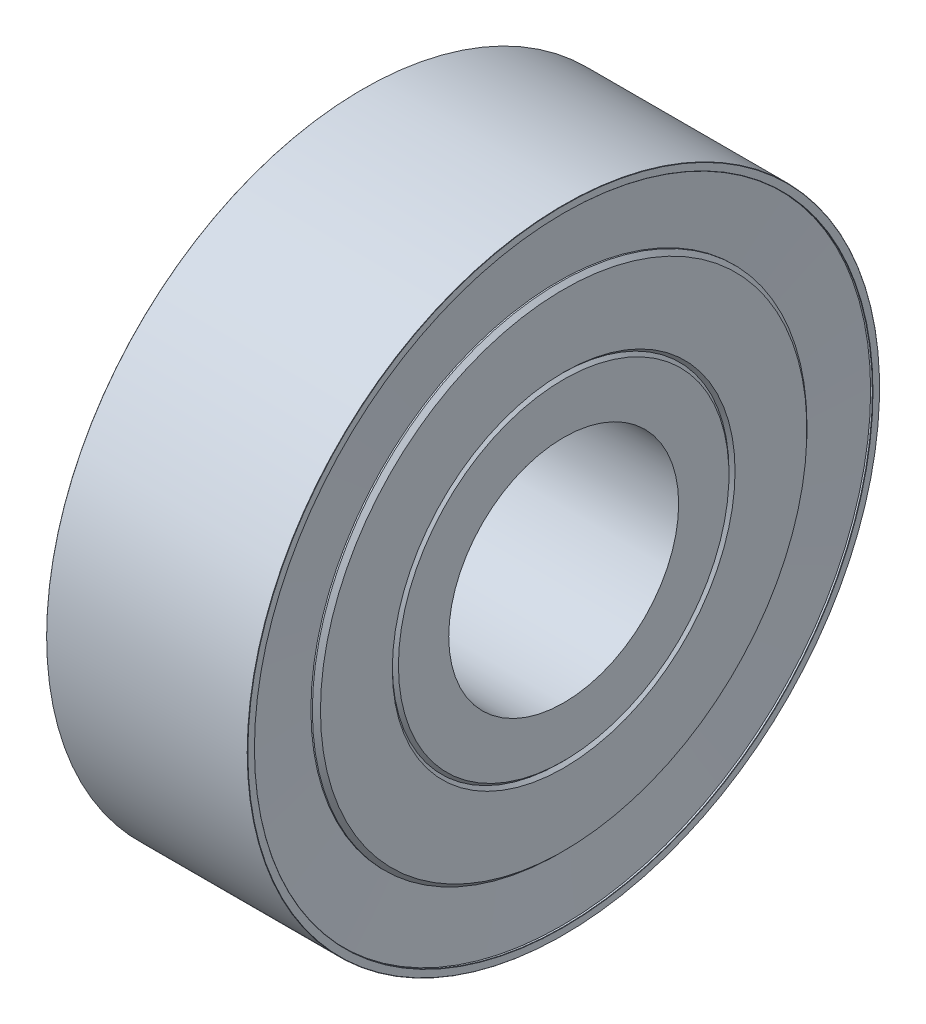
ISO-10303-21;
HEADER;
FILE_DESCRIPTION(('STEP AP214'),'2;1');
FILE_NAME('part.step','',(''),(''),'','','');
FILE_SCHEMA(('AUTOMOTIVE_DESIGN { 1 0 10303 214 1 1 1 1 }'));
ENDSEC;
DATA;
#1=APPLICATION_CONTEXT('core data for automotive mechanical design processes');
#2=APPLICATION_PROTOCOL_DEFINITION('international standard','automotive_design',2000,#1);
#3=PRODUCT_CONTEXT('',#1,'mechanical');
#4=PRODUCT('Part','Part','',(#3));
#5=PRODUCT_RELATED_PRODUCT_CATEGORY('part','',(#4));
#6=PRODUCT_DEFINITION_FORMATION('','',#4);
#7=PRODUCT_DEFINITION_CONTEXT('part definition',#1,'design');
#8=PRODUCT_DEFINITION('design','',#6,#7);
#9=PRODUCT_DEFINITION_SHAPE('','',#8);
#10=(LENGTH_UNIT() NAMED_UNIT(*) SI_UNIT(.MILLI.,.METRE.));
#11=(NAMED_UNIT(*) PLANE_ANGLE_UNIT() SI_UNIT($,.RADIAN.));
#12=(NAMED_UNIT(*) SI_UNIT($,.STERADIAN.) SOLID_ANGLE_UNIT());
#13=UNCERTAINTY_MEASURE_WITH_UNIT(LENGTH_MEASURE(1.E-05),#10,'distance_accuracy_value','');
#14=(GEOMETRIC_REPRESENTATION_CONTEXT(3) GLOBAL_UNCERTAINTY_ASSIGNED_CONTEXT((#13)) GLOBAL_UNIT_ASSIGNED_CONTEXT((#10,
#11,#12)) REPRESENTATION_CONTEXT('',''));
#15=CARTESIAN_POINT('',(0.,0.,0.));
#16=DIRECTION('',(0.,0.,1.));
#17=DIRECTION('',(1.,0.,0.));
#18=AXIS2_PLACEMENT_3D('',#15,#16,#17);
#19=CARTESIAN_POINT('',(3.5,-4.20404369287366,0.));
#20=DIRECTION('',(1.,0.,0.));
#21=DIRECTION('',(0.,0.,-1.));
#22=AXIS2_PLACEMENT_3D('',#19,#20,#21);
#23=PLANE('',#22);
#24=CARTESIAN_POINT('',(3.5,0.,0.));
#25=DIRECTION('',(-1.,0.,0.));
#26=DIRECTION('',(0.,0.,1.));
#27=AXIS2_PLACEMENT_3D('',#24,#25,#26);
#28=CIRCLE('',#27,4.);
#29=CARTESIAN_POINT('',(3.5,0.,4.));
#30=VERTEX_POINT('',#29);
#31=EDGE_CURVE('E108',#30,#30,#28,.T.);
#32=ORIENTED_EDGE('',*,*,#31,.T.);
#33=EDGE_LOOP('',(#32));
#34=FACE_BOUND('',#33,.T.);
#35=CARTESIAN_POINT('',(3.5,0.,0.));
#36=DIRECTION('',(-1.,0.,0.));
#37=DIRECTION('',(0.,0.,1.));
#38=AXIS2_PLACEMENT_3D('',#35,#36,#37);
#39=CIRCLE('',#38,5.75);
#40=CARTESIAN_POINT('',(3.5,0.,5.75));
#41=VERTEX_POINT('',#40);
#42=EDGE_CURVE('E10',#41,#41,#39,.T.);
#43=ORIENTED_EDGE('',*,*,#42,.F.);
#44=EDGE_LOOP('',(#43));
#45=FACE_BOUND('',#44,.T.);
#46=ADVANCED_FACE('F32',(#34,#45),#23,.T.);
#47=CARTESIAN_POINT('',(3.5,0.,0.));
#48=DIRECTION('',(-1.,0.,0.));
#49=DIRECTION('',(0.,0.,1.));
#50=AXIS2_PLACEMENT_3D('',#47,#48,#49);
#51=CONICAL_SURFACE('',#50,5.75,0.785398163397452);
#52=CARTESIAN_POINT('',(3.39393398282202,0.,0.));
#53=DIRECTION('',(-1.,0.,0.));
#54=DIRECTION('',(0.,0.,1.));
#55=AXIS2_PLACEMENT_3D('',#52,#53,#54);
#56=CIRCLE('',#55,5.85606601717798);
#57=CARTESIAN_POINT('',(3.39393398282202,0.,5.85606601717798));
#58=VERTEX_POINT('',#57);
#59=EDGE_CURVE('E38',#58,#58,#56,.T.);
#60=ORIENTED_EDGE('',*,*,#59,.F.);
#61=EDGE_LOOP('',(#60));
#62=FACE_BOUND('',#61,.T.);
#63=ORIENTED_EDGE('',*,*,#42,.T.);
#64=EDGE_LOOP('',(#63));
#65=FACE_BOUND('',#64,.T.);
#66=ADVANCED_FACE('F138',(#62,#65),#51,.T.);
#67=CARTESIAN_POINT('',(3.39393398282202,0.,0.));
#68=DIRECTION('',(1.,0.,0.));
#69=DIRECTION('',(0.,0.,-1.));
#70=AXIS2_PLACEMENT_3D('',#67,#68,#69);
#71=CONICAL_SURFACE('',#70,5.85606601717798,0.785398163397457);
#72=CARTESIAN_POINT('',(3.5,0.,0.));
#73=DIRECTION('',(-1.,0.,0.));
#74=DIRECTION('',(0.,0.,1.));
#75=AXIS2_PLACEMENT_3D('',#72,#73,#74);
#76=CIRCLE('',#75,5.96213203435596);
#77=CARTESIAN_POINT('',(3.5,0.,5.96213203435596));
#78=VERTEX_POINT('',#77);
#79=EDGE_CURVE('E42',#78,#78,#76,.T.);
#80=ORIENTED_EDGE('',*,*,#79,.F.);
#81=EDGE_LOOP('',(#80));
#82=FACE_BOUND('',#81,.T.);
#83=ORIENTED_EDGE('',*,*,#59,.T.);
#84=EDGE_LOOP('',(#83));
#85=FACE_BOUND('',#84,.T.);
#86=ADVANCED_FACE('F142',(#82,#85),#71,.F.);
#87=CARTESIAN_POINT('',(3.5,-4.20404369287366,0.));
#88=DIRECTION('',(-1.,0.,0.));
#89=DIRECTION('',(0.,0.,1.));
#90=AXIS2_PLACEMENT_3D('',#87,#88,#89);
#91=PLANE('',#90);
#92=CARTESIAN_POINT('',(3.5,0.,0.));
#93=DIRECTION('',(-1.,0.,0.));
#94=DIRECTION('',(0.,0.,1.));
#95=AXIS2_PLACEMENT_3D('',#92,#93,#94);
#96=CIRCLE('',#95,8.46213203435596);
#97=CARTESIAN_POINT('',(3.5,0.,8.46213203435596));
#98=VERTEX_POINT('',#97);
#99=EDGE_CURVE('E46',#98,#98,#96,.T.);
#100=ORIENTED_EDGE('',*,*,#99,.F.);
#101=EDGE_LOOP('',(#100));
#102=FACE_BOUND('',#101,.T.);
#103=ORIENTED_EDGE('',*,*,#79,.T.);
#104=EDGE_LOOP('',(#103));
#105=FACE_BOUND('',#104,.T.);
#106=ADVANCED_FACE('F147',(#102,#105),#91,.F.);
#107=CARTESIAN_POINT('',(3.5,0.,0.));
#108=DIRECTION('',(-1.,0.,0.));
#109=DIRECTION('',(0.,0.,1.));
#110=AXIS2_PLACEMENT_3D('',#107,#108,#109);
#111=CONICAL_SURFACE('',#110,8.46213203435596,0.785398163397453);
#112=CARTESIAN_POINT('',(3.35857864376269,0.,0.));
#113=DIRECTION('',(-1.,0.,0.));
#114=DIRECTION('',(0.,0.,1.));
#115=AXIS2_PLACEMENT_3D('',#112,#113,#114);
#116=CIRCLE('',#115,8.60355339059327);
#117=CARTESIAN_POINT('',(3.35857864376269,0.,8.60355339059327));
#118=VERTEX_POINT('',#117);
#119=EDGE_CURVE('E51',#118,#118,#116,.T.);
#120=ORIENTED_EDGE('',*,*,#119,.F.);
#121=EDGE_LOOP('',(#120));
#122=FACE_BOUND('',#121,.T.);
#123=ORIENTED_EDGE('',*,*,#99,.T.);
#124=EDGE_LOOP('',(#123));
#125=FACE_BOUND('',#124,.T.);
#126=ADVANCED_FACE('F153',(#122,#125),#111,.T.);
#127=CARTESIAN_POINT('',(-0.542847520080159,0.,0.));
#128=DIRECTION('',(-1.,0.,0.));
#129=DIRECTION('',(0.,0.,1.));
#130=AXIS2_PLACEMENT_3D('',#127,#128,#129);
#131=CYLINDRICAL_SURFACE('',#130,8.60355339059327);
#132=CARTESIAN_POINT('',(3.30857864376269,0.,0.));
#133=DIRECTION('',(-1.,0.,0.));
#134=DIRECTION('',(0.,0.,1.));
#135=AXIS2_PLACEMENT_3D('',#132,#133,#134);
#136=CIRCLE('',#135,8.60355339059327);
#137=CARTESIAN_POINT('',(3.30857864376269,0.,8.60355339059327));
#138=VERTEX_POINT('',#137);
#139=EDGE_CURVE('E54',#138,#138,#136,.T.);
#140=ORIENTED_EDGE('',*,*,#139,.F.);
#141=EDGE_LOOP('',(#140));
#142=FACE_BOUND('',#141,.T.);
#143=ORIENTED_EDGE('',*,*,#119,.T.);
#144=EDGE_LOOP('',(#143));
#145=FACE_BOUND('',#144,.T.);
#146=ADVANCED_FACE('F157',(#142,#145),#131,.T.);
#147=CARTESIAN_POINT('',(3.42928932188134,0.,0.));
#148=DIRECTION('',(1.,0.,0.));
#149=DIRECTION('',(0.,0.,-1.));
#150=AXIS2_PLACEMENT_3D('',#147,#148,#149);
#151=CONICAL_SURFACE('',#150,10.75,1.51461805369169);
#152=ORIENTED_EDGE('',*,*,#139,.T.);
#153=EDGE_LOOP('',(#152));
#154=FACE_BOUND('',#153,.T.);
#155=CARTESIAN_POINT('',(3.42928932188134,0.,0.));
#156=DIRECTION('',(-1.,0.,0.));
#157=DIRECTION('',(0.,0.,1.));
#158=AXIS2_PLACEMENT_3D('',#155,#156,#157);
#159=CIRCLE('',#158,10.75);
#160=CARTESIAN_POINT('',(3.42928932188134,0.,10.75));
#161=VERTEX_POINT('',#160);
#162=EDGE_CURVE('E57',#161,#161,#159,.T.);
#163=ORIENTED_EDGE('',*,*,#162,.F.);
#164=EDGE_LOOP('',(#163));
#165=FACE_BOUND('',#164,.T.);
#166=ADVANCED_FACE('F161',(#154,#165),#151,.F.);
#167=CARTESIAN_POINT('',(-0.542847520080159,0.,0.));
#168=DIRECTION('',(-1.,0.,0.));
#169=DIRECTION('',(0.,0.,1.));
#170=AXIS2_PLACEMENT_3D('',#167,#168,#169);
#171=CYLINDRICAL_SURFACE('',#170,10.75);
#172=CARTESIAN_POINT('',(3.49,0.,0.));
#173=DIRECTION('',(-1.,0.,0.));
#174=DIRECTION('',(0.,0.,1.));
#175=AXIS2_PLACEMENT_3D('',#172,#173,#174);
#176=CIRCLE('',#175,10.75);
#177=CARTESIAN_POINT('',(3.49,0.,10.75));
#178=VERTEX_POINT('',#177);
#179=EDGE_CURVE('E60',#178,#178,#176,.T.);
#180=ORIENTED_EDGE('',*,*,#179,.F.);
#181=EDGE_LOOP('',(#180));
#182=FACE_BOUND('',#181,.T.);
#183=ORIENTED_EDGE('',*,*,#162,.T.);
#184=EDGE_LOOP('',(#183));
#185=FACE_BOUND('',#184,.T.);
#186=ADVANCED_FACE('F165',(#182,#185),#171,.F.);
#187=CARTESIAN_POINT('',(3.5,0.,0.));
#188=DIRECTION('',(1.,0.,0.));
#189=DIRECTION('',(0.,0.,-1.));
#190=AXIS2_PLACEMENT_3D('',#187,#188,#189);
#191=CONICAL_SURFACE('',#190,10.76,0.785398163397362);
#192=ORIENTED_EDGE('',*,*,#179,.T.);
#193=EDGE_LOOP('',(#192));
#194=FACE_BOUND('',#193,.T.);
#195=CARTESIAN_POINT('',(3.5,0.,0.));
#196=DIRECTION('',(-1.,0.,0.));
#197=DIRECTION('',(0.,0.,1.));
#198=AXIS2_PLACEMENT_3D('',#195,#196,#197);
#199=CIRCLE('',#198,10.76);
#200=CARTESIAN_POINT('',(3.5,0.,10.76));
#201=VERTEX_POINT('',#200);
#202=EDGE_CURVE('E63',#201,#201,#199,.T.);
#203=ORIENTED_EDGE('',*,*,#202,.F.);
#204=EDGE_LOOP('',(#203));
#205=FACE_BOUND('',#204,.T.);
#206=ADVANCED_FACE('F169',(#194,#205),#191,.F.);
#207=CARTESIAN_POINT('',(3.5,-4.20404369287366,0.));
#208=DIRECTION('',(1.,0.,0.));
#209=DIRECTION('',(0.,0.,-1.));
#210=AXIS2_PLACEMENT_3D('',#207,#208,#209);
#211=PLANE('',#210);
#212=ORIENTED_EDGE('',*,*,#202,.T.);
#213=EDGE_LOOP('',(#212));
#214=FACE_BOUND('',#213,.T.);
#215=CARTESIAN_POINT('',(3.5,0.,0.));
#216=DIRECTION('',(-1.,0.,0.));
#217=DIRECTION('',(0.,0.,1.));
#218=AXIS2_PLACEMENT_3D('',#215,#216,#217);
#219=CIRCLE('',#218,10.99);
#220=CARTESIAN_POINT('',(3.5,0.,10.99));
#221=VERTEX_POINT('',#220);
#222=EDGE_CURVE('E66',#221,#221,#219,.T.);
#223=ORIENTED_EDGE('',*,*,#222,.F.);
#224=EDGE_LOOP('',(#223));
#225=FACE_BOUND('',#224,.T.);
#226=ADVANCED_FACE('F173',(#214,#225),#211,.T.);
#227=CARTESIAN_POINT('',(3.5,0.,0.));
#228=DIRECTION('',(-1.,0.,0.));
#229=DIRECTION('',(0.,0.,1.));
#230=AXIS2_PLACEMENT_3D('',#227,#228,#229);
#231=CONICAL_SURFACE('',#230,10.99,0.746306868197029);
#232=CARTESIAN_POINT('',(3.48918593659618,0.,0.));
#233=DIRECTION('',(-1.,0.,0.));
#234=DIRECTION('',(0.,0.,1.));
#235=AXIS2_PLACEMENT_3D('',#232,#233,#234);
#236=CIRCLE('',#235,11.);
#237=CARTESIAN_POINT('',(3.48918593659618,0.,11.));
#238=VERTEX_POINT('',#237);
#239=EDGE_CURVE('E69',#238,#238,#236,.T.);
#240=ORIENTED_EDGE('',*,*,#239,.F.);
#241=EDGE_LOOP('',(#240));
#242=FACE_BOUND('',#241,.T.);
#243=ORIENTED_EDGE('',*,*,#222,.T.);
#244=EDGE_LOOP('',(#243));
#245=FACE_BOUND('',#244,.T.);
#246=ADVANCED_FACE('F177',(#242,#245),#231,.T.);
#247=CARTESIAN_POINT('',(-0.542847520080159,0.,0.));
#248=DIRECTION('',(-1.,0.,0.));
#249=DIRECTION('',(0.,0.,1.));
#250=AXIS2_PLACEMENT_3D('',#247,#248,#249);
#251=CYLINDRICAL_SURFACE('',#250,11.);
#252=CARTESIAN_POINT('',(-3.48918593659618,0.,0.));
#253=DIRECTION('',(-1.,0.,0.));
#254=DIRECTION('',(0.,0.,1.));
#255=AXIS2_PLACEMENT_3D('',#252,#253,#254);
#256=CIRCLE('',#255,11.);
#257=CARTESIAN_POINT('',(-3.48918593659618,0.,11.));
#258=VERTEX_POINT('',#257);
#259=EDGE_CURVE('E72',#258,#258,#256,.T.);
#260=ORIENTED_EDGE('',*,*,#259,.F.);
#261=EDGE_LOOP('',(#260));
#262=FACE_BOUND('',#261,.T.);
#263=ORIENTED_EDGE('',*,*,#239,.T.);
#264=EDGE_LOOP('',(#263));
#265=FACE_BOUND('',#264,.T.);
#266=ADVANCED_FACE('F181',(#262,#265),#251,.T.);
#267=CARTESIAN_POINT('',(-3.5,0.,0.));
#268=DIRECTION('',(1.,0.,0.));
#269=DIRECTION('',(0.,0.,-1.));
#270=AXIS2_PLACEMENT_3D('',#267,#268,#269);
#271=CONICAL_SURFACE('',#270,10.99,0.746306868197035);
#272=ORIENTED_EDGE('',*,*,#259,.T.);
#273=EDGE_LOOP('',(#272));
#274=FACE_BOUND('',#273,.T.);
#275=CARTESIAN_POINT('',(-3.5,0.,0.));
#276=DIRECTION('',(-1.,0.,0.));
#277=DIRECTION('',(0.,0.,1.));
#278=AXIS2_PLACEMENT_3D('',#275,#276,#277);
#279=CIRCLE('',#278,10.99);
#280=CARTESIAN_POINT('',(-3.5,0.,10.99));
#281=VERTEX_POINT('',#280);
#282=EDGE_CURVE('E75',#281,#281,#279,.T.);
#283=ORIENTED_EDGE('',*,*,#282,.F.);
#284=EDGE_LOOP('',(#283));
#285=FACE_BOUND('',#284,.T.);
#286=ADVANCED_FACE('F185',(#274,#285),#271,.T.);
#287=CARTESIAN_POINT('',(-3.5,-4.20404369287366,0.));
#288=DIRECTION('',(1.,0.,0.));
#289=DIRECTION('',(0.,0.,-1.));
#290=AXIS2_PLACEMENT_3D('',#287,#288,#289);
#291=PLANE('',#290);
#292=CARTESIAN_POINT('',(-3.5,0.,0.));
#293=DIRECTION('',(-1.,0.,0.));
#294=DIRECTION('',(0.,0.,1.));
#295=AXIS2_PLACEMENT_3D('',#292,#293,#294);
#296=CIRCLE('',#295,10.76);
#297=CARTESIAN_POINT('',(-3.5,0.,10.76));
#298=VERTEX_POINT('',#297);
#299=EDGE_CURVE('E78',#298,#298,#296,.T.);
#300=ORIENTED_EDGE('',*,*,#299,.F.);
#301=EDGE_LOOP('',(#300));
#302=FACE_BOUND('',#301,.T.);
#303=ORIENTED_EDGE('',*,*,#282,.T.);
#304=EDGE_LOOP('',(#303));
#305=FACE_BOUND('',#304,.T.);
#306=ADVANCED_FACE('F189',(#302,#305),#291,.F.);
#307=CARTESIAN_POINT('',(-3.5,0.,0.));
#308=DIRECTION('',(-1.,0.,0.));
#309=DIRECTION('',(0.,0.,1.));
#310=AXIS2_PLACEMENT_3D('',#307,#308,#309);
#311=CONICAL_SURFACE('',#310,10.76,0.785398163397405);
#312=CARTESIAN_POINT('',(-3.49,0.,0.));
#313=DIRECTION('',(-1.,0.,0.));
#314=DIRECTION('',(0.,0.,1.));
#315=AXIS2_PLACEMENT_3D('',#312,#313,#314);
#316=CIRCLE('',#315,10.75);
#317=CARTESIAN_POINT('',(-3.49,0.,10.75));
#318=VERTEX_POINT('',#317);
#319=EDGE_CURVE('E81',#318,#318,#316,.T.);
#320=ORIENTED_EDGE('',*,*,#319,.F.);
#321=EDGE_LOOP('',(#320));
#322=FACE_BOUND('',#321,.T.);
#323=ORIENTED_EDGE('',*,*,#299,.T.);
#324=EDGE_LOOP('',(#323));
#325=FACE_BOUND('',#324,.T.);
#326=ADVANCED_FACE('F193',(#322,#325),#311,.F.);
#327=CARTESIAN_POINT('',(-0.542847520080159,0.,0.));
#328=DIRECTION('',(-1.,0.,0.));
#329=DIRECTION('',(0.,0.,1.));
#330=AXIS2_PLACEMENT_3D('',#327,#328,#329);
#331=CYLINDRICAL_SURFACE('',#330,10.75);
#332=ORIENTED_EDGE('',*,*,#319,.T.);
#333=EDGE_LOOP('',(#332));
#334=FACE_BOUND('',#333,.T.);
#335=CARTESIAN_POINT('',(-3.42928932188134,0.,0.));
#336=DIRECTION('',(-1.,0.,0.));
#337=DIRECTION('',(0.,0.,1.));
#338=AXIS2_PLACEMENT_3D('',#335,#336,#337);
#339=CIRCLE('',#338,10.75);
#340=CARTESIAN_POINT('',(-3.42928932188134,0.,10.75));
#341=VERTEX_POINT('',#340);
#342=EDGE_CURVE('E84',#341,#341,#339,.T.);
#343=ORIENTED_EDGE('',*,*,#342,.F.);
#344=EDGE_LOOP('',(#343));
#345=FACE_BOUND('',#344,.T.);
#346=ADVANCED_FACE('F197',(#334,#345),#331,.F.);
#347=CARTESIAN_POINT('',(-3.42928932188134,0.,0.));
#348=DIRECTION('',(-1.,0.,0.));
#349=DIRECTION('',(0.,0.,1.));
#350=AXIS2_PLACEMENT_3D('',#347,#348,#349);
#351=CONICAL_SURFACE('',#350,10.75,1.51461805369169);
#352=CARTESIAN_POINT('',(-3.30857864376269,0.,0.));
#353=DIRECTION('',(-1.,0.,0.));
#354=DIRECTION('',(0.,0.,1.));
#355=AXIS2_PLACEMENT_3D('',#352,#353,#354);
#356=CIRCLE('',#355,8.60355339059327);
#357=CARTESIAN_POINT('',(-3.30857864376269,0.,8.60355339059327));
#358=VERTEX_POINT('',#357);
#359=EDGE_CURVE('E87',#358,#358,#356,.T.);
#360=ORIENTED_EDGE('',*,*,#359,.F.);
#361=EDGE_LOOP('',(#360));
#362=FACE_BOUND('',#361,.T.);
#363=ORIENTED_EDGE('',*,*,#342,.T.);
#364=EDGE_LOOP('',(#363));
#365=FACE_BOUND('',#364,.T.);
#366=ADVANCED_FACE('F201',(#362,#365),#351,.F.);
#367=CARTESIAN_POINT('',(-0.542847520080159,0.,0.));
#368=DIRECTION('',(-1.,0.,0.));
#369=DIRECTION('',(0.,0.,1.));
#370=AXIS2_PLACEMENT_3D('',#367,#368,#369);
#371=CYLINDRICAL_SURFACE('',#370,8.60355339059327);
#372=ORIENTED_EDGE('',*,*,#359,.T.);
#373=EDGE_LOOP('',(#372));
#374=FACE_BOUND('',#373,.T.);
#375=CARTESIAN_POINT('',(-3.35857864376269,0.,0.));
#376=DIRECTION('',(-1.,0.,0.));
#377=DIRECTION('',(0.,0.,1.));
#378=AXIS2_PLACEMENT_3D('',#375,#376,#377);
#379=CIRCLE('',#378,8.60355339059327);
#380=CARTESIAN_POINT('',(-3.35857864376269,0.,8.60355339059327));
#381=VERTEX_POINT('',#380);
#382=EDGE_CURVE('E90',#381,#381,#379,.T.);
#383=ORIENTED_EDGE('',*,*,#382,.F.);
#384=EDGE_LOOP('',(#383));
#385=FACE_BOUND('',#384,.T.);
#386=ADVANCED_FACE('F205',(#374,#385),#371,.T.);
#387=CARTESIAN_POINT('',(-3.5,0.,0.));
#388=DIRECTION('',(1.,0.,0.));
#389=DIRECTION('',(0.,0.,-1.));
#390=AXIS2_PLACEMENT_3D('',#387,#388,#389);
#391=CONICAL_SURFACE('',#390,8.46213203435597,0.785398163397435);
#392=ORIENTED_EDGE('',*,*,#382,.T.);
#393=EDGE_LOOP('',(#392));
#394=FACE_BOUND('',#393,.T.);
#395=CARTESIAN_POINT('',(-3.5,0.,0.));
#396=DIRECTION('',(-1.,0.,0.));
#397=DIRECTION('',(0.,0.,1.));
#398=AXIS2_PLACEMENT_3D('',#395,#396,#397);
#399=CIRCLE('',#398,8.46213203435597);
#400=CARTESIAN_POINT('',(-3.5,0.,8.46213203435597));
#401=VERTEX_POINT('',#400);
#402=EDGE_CURVE('E93',#401,#401,#399,.T.);
#403=ORIENTED_EDGE('',*,*,#402,.F.);
#404=EDGE_LOOP('',(#403));
#405=FACE_BOUND('',#404,.T.);
#406=ADVANCED_FACE('F209',(#394,#405),#391,.T.);
#407=CARTESIAN_POINT('',(-3.5,-4.20404369287366,0.));
#408=DIRECTION('',(-1.,0.,0.));
#409=DIRECTION('',(0.,0.,1.));
#410=AXIS2_PLACEMENT_3D('',#407,#408,#409);
#411=PLANE('',#410);
#412=ORIENTED_EDGE('',*,*,#402,.T.);
#413=EDGE_LOOP('',(#412));
#414=FACE_BOUND('',#413,.T.);
#415=CARTESIAN_POINT('',(-3.5,0.,0.));
#416=DIRECTION('',(-1.,0.,0.));
#417=DIRECTION('',(0.,0.,1.));
#418=AXIS2_PLACEMENT_3D('',#415,#416,#417);
#419=CIRCLE('',#418,5.96213203435596);
#420=CARTESIAN_POINT('',(-3.5,0.,5.96213203435596));
#421=VERTEX_POINT('',#420);
#422=EDGE_CURVE('E96',#421,#421,#419,.T.);
#423=ORIENTED_EDGE('',*,*,#422,.F.);
#424=EDGE_LOOP('',(#423));
#425=FACE_BOUND('',#424,.T.);
#426=ADVANCED_FACE('F134',(#414,#425),#411,.T.);
#427=CARTESIAN_POINT('',(-3.39393398282202,0.,0.));
#428=DIRECTION('',(-1.,0.,0.));
#429=DIRECTION('',(0.,0.,1.));
#430=AXIS2_PLACEMENT_3D('',#427,#428,#429);
#431=CONICAL_SURFACE('',#430,5.85606601717798,0.785398163397458);
#432=ORIENTED_EDGE('',*,*,#422,.T.);
#433=EDGE_LOOP('',(#432));
#434=FACE_BOUND('',#433,.T.);
#435=CARTESIAN_POINT('',(-3.39393398282202,0.,0.));
#436=DIRECTION('',(-1.,0.,0.));
#437=DIRECTION('',(0.,0.,1.));
#438=AXIS2_PLACEMENT_3D('',#435,#436,#437);
#439=CIRCLE('',#438,5.85606601717798);
#440=CARTESIAN_POINT('',(-3.39393398282202,0.,5.85606601717798));
#441=VERTEX_POINT('',#440);
#442=EDGE_CURVE('E99',#441,#441,#439,.T.);
#443=ORIENTED_EDGE('',*,*,#442,.F.);
#444=EDGE_LOOP('',(#443));
#445=FACE_BOUND('',#444,.T.);
#446=ADVANCED_FACE('F128',(#434,#445),#431,.F.);
#447=CARTESIAN_POINT('',(-3.5,0.,0.));
#448=DIRECTION('',(1.,0.,0.));
#449=DIRECTION('',(0.,0.,-1.));
#450=AXIS2_PLACEMENT_3D('',#447,#448,#449);
#451=CONICAL_SURFACE('',#450,5.75,0.785398163397446);
#452=ORIENTED_EDGE('',*,*,#442,.T.);
#453=EDGE_LOOP('',(#452));
#454=FACE_BOUND('',#453,.T.);
#455=CARTESIAN_POINT('',(-3.5,0.,0.));
#456=DIRECTION('',(-1.,0.,0.));
#457=DIRECTION('',(0.,0.,1.));
#458=AXIS2_PLACEMENT_3D('',#455,#456,#457);
#459=CIRCLE('',#458,5.75);
#460=CARTESIAN_POINT('',(-3.5,0.,5.75));
#461=VERTEX_POINT('',#460);
#462=EDGE_CURVE('E102',#461,#461,#459,.T.);
#463=ORIENTED_EDGE('',*,*,#462,.F.);
#464=EDGE_LOOP('',(#463));
#465=FACE_BOUND('',#464,.T.);
#466=ADVANCED_FACE('F123',(#454,#465),#451,.T.);
#467=CARTESIAN_POINT('',(-3.5,-4.20404369287366,0.));
#468=DIRECTION('',(1.,0.,0.));
#469=DIRECTION('',(0.,0.,-1.));
#470=AXIS2_PLACEMENT_3D('',#467,#468,#469);
#471=PLANE('',#470);
#472=CARTESIAN_POINT('',(-3.5,0.,0.));
#473=DIRECTION('',(-1.,0.,0.));
#474=DIRECTION('',(0.,0.,1.));
#475=AXIS2_PLACEMENT_3D('',#472,#473,#474);
#476=CIRCLE('',#475,4.);
#477=CARTESIAN_POINT('',(-3.5,0.,4.));
#478=VERTEX_POINT('',#477);
#479=EDGE_CURVE('E105',#478,#478,#476,.T.);
#480=ORIENTED_EDGE('',*,*,#479,.F.);
#481=EDGE_LOOP('',(#480));
#482=FACE_BOUND('',#481,.T.);
#483=ORIENTED_EDGE('',*,*,#462,.T.);
#484=EDGE_LOOP('',(#483));
#485=FACE_BOUND('',#484,.T.);
#486=ADVANCED_FACE('F117',(#482,#485),#471,.F.);
#487=CARTESIAN_POINT('',(-0.542847520080159,0.,0.));
#488=DIRECTION('',(-1.,0.,0.));
#489=DIRECTION('',(0.,0.,1.));
#490=AXIS2_PLACEMENT_3D('',#487,#488,#489);
#491=CYLINDRICAL_SURFACE('',#490,4.);
#492=ORIENTED_EDGE('',*,*,#31,.F.);
#493=EDGE_LOOP('',(#492));
#494=FACE_BOUND('',#493,.T.);
#495=ORIENTED_EDGE('',*,*,#479,.T.);
#496=EDGE_LOOP('',(#495));
#497=FACE_BOUND('',#496,.T.);
#498=ADVANCED_FACE('F114',(#494,#497),#491,.F.);
#499=CLOSED_SHELL('',(#46,#66,#86,#106,#126,#146,#166,#186,#206,#226,#246,#266,#286,#306,#326,
#346,#366,#386,#406,#426,#446,#466,#486,#498));
#500=MANIFOLD_SOLID_BREP('B2',#499);
#501=ADVANCED_BREP_SHAPE_REPRESENTATION('',(#18,#500),#14);
#502=SHAPE_DEFINITION_REPRESENTATION(#9,#501);
ENDSEC;
END-ISO-10303-21;
